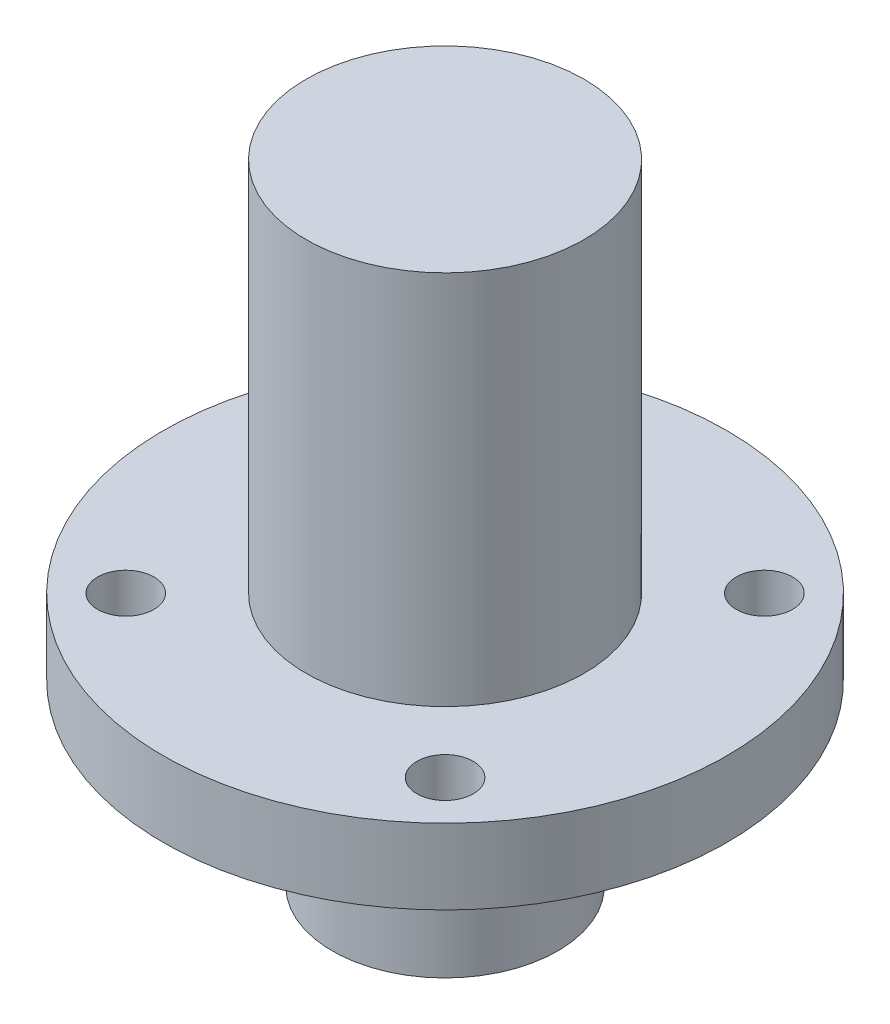
ISO-10303-21;
HEADER;
FILE_DESCRIPTION(('STEP AP214'),'2;1');
FILE_NAME('part.step','',(''),(''),'','','');
FILE_SCHEMA(('AUTOMOTIVE_DESIGN { 1 0 10303 214 1 1 1 1 }'));
ENDSEC;
DATA;
#1=APPLICATION_CONTEXT('core data for automotive mechanical design processes');
#2=APPLICATION_PROTOCOL_DEFINITION('international standard','automotive_design',2000,#1);
#3=PRODUCT_CONTEXT('',#1,'mechanical');
#4=PRODUCT('Part','Part','',(#3));
#5=PRODUCT_RELATED_PRODUCT_CATEGORY('part','',(#4));
#6=PRODUCT_DEFINITION_FORMATION('','',#4);
#7=PRODUCT_DEFINITION_CONTEXT('part definition',#1,'design');
#8=PRODUCT_DEFINITION('design','',#6,#7);
#9=PRODUCT_DEFINITION_SHAPE('','',#8);
#10=(LENGTH_UNIT() NAMED_UNIT(*) SI_UNIT(.MILLI.,.METRE.));
#11=(NAMED_UNIT(*) PLANE_ANGLE_UNIT() SI_UNIT($,.RADIAN.));
#12=(NAMED_UNIT(*) SI_UNIT($,.STERADIAN.) SOLID_ANGLE_UNIT());
#13=UNCERTAINTY_MEASURE_WITH_UNIT(LENGTH_MEASURE(1.E-05),#10,'distance_accuracy_value','');
#14=(GEOMETRIC_REPRESENTATION_CONTEXT(3) GLOBAL_UNCERTAINTY_ASSIGNED_CONTEXT((#13)) GLOBAL_UNIT_ASSIGNED_CONTEXT((#10,
#11,#12)) REPRESENTATION_CONTEXT('',''));
#15=CARTESIAN_POINT('',(0.,0.,0.));
#16=DIRECTION('',(0.,0.,1.));
#17=DIRECTION('',(1.,0.,0.));
#18=AXIS2_PLACEMENT_3D('',#15,#16,#17);
#19=CARTESIAN_POINT('',(0.,0.,0.));
#20=DIRECTION('',(0.,1.,0.));
#21=DIRECTION('',(0.,0.,1.));
#22=AXIS2_PLACEMENT_3D('',#19,#20,#21);
#23=PLANE('',#22);
#24=CARTESIAN_POINT('',(0.,0.,0.));
#25=DIRECTION('',(0.,1.,0.));
#26=DIRECTION('',(0.,0.,1.));
#27=AXIS2_PLACEMENT_3D('',#24,#25,#26);
#28=CIRCLE('',#27,3.);
#29=CARTESIAN_POINT('',(0.,0.,3.));
#30=VERTEX_POINT('',#29);
#31=EDGE_CURVE('E18',#30,#30,#28,.F.);
#32=ORIENTED_EDGE('',*,*,#31,.T.);
#33=EDGE_LOOP('',(#32));
#34=FACE_BOUND('',#33,.T.);
#35=ADVANCED_FACE('F15',(#34),#23,.F.);
#36=CARTESIAN_POINT('',(0.,-13.5,0.));
#37=DIRECTION('',(0.,1.,0.));
#38=DIRECTION('',(0.,0.,1.));
#39=AXIS2_PLACEMENT_3D('',#36,#37,#38);
#40=CYLINDRICAL_SURFACE('',#39,3.);
#41=CARTESIAN_POINT('',(0.,-13.5,0.));
#42=DIRECTION('',(0.,1.,0.));
#43=DIRECTION('',(0.,0.,1.));
#44=AXIS2_PLACEMENT_3D('',#41,#42,#43);
#45=CIRCLE('',#44,3.);
#46=CARTESIAN_POINT('',(0.,-13.5,3.00000000000001));
#47=VERTEX_POINT('',#46);
#48=EDGE_CURVE('E231',#47,#47,#45,.F.);
#49=ORIENTED_EDGE('',*,*,#48,.T.);
#50=EDGE_LOOP('',(#49));
#51=FACE_BOUND('',#50,.T.);
#52=ORIENTED_EDGE('',*,*,#31,.F.);
#53=EDGE_LOOP('',(#52));
#54=FACE_BOUND('',#53,.T.);
#55=CARTESIAN_POINT('',(0.,-7.875,3.));
#56=CARTESIAN_POINT('',(-0.0557681985187937,-7.87500315639322,2.99999771774197));
#57=CARTESIAN_POINT('',(-0.111592826024643,-7.87957270352456,2.99842813446581));
#58=CARTESIAN_POINT('',(-0.221651603388951,-7.89769444796325,2.99231039992411));
#59=CARTESIAN_POINT('',(-0.275882995246631,-7.91126136185447,2.98775736891462));
#60=CARTESIAN_POINT('',(-0.381064108690752,-7.94685282185869,2.97616923326795));
#61=CARTESIAN_POINT('',(-0.432021235043023,-7.9688574391952,2.96913998030726));
#62=CARTESIAN_POINT('',(-0.529502310394442,-8.02062537747109,2.95331495585036));
#63=CARTESIAN_POINT('',(-0.5760267382639,-8.05038785901734,2.94451937549263));
#64=CARTESIAN_POINT('',(-0.665032275740394,-8.11796397160462,2.92572548917805));
#65=CARTESIAN_POINT('',(-0.707331121420946,-8.15600930824795,2.91569723263784));
#66=CARTESIAN_POINT('',(-0.785090323506353,-8.23858034903304,2.89572929041068));
#67=CARTESIAN_POINT('',(-0.820548717152931,-8.28310790673287,2.88578963092323));
#68=CARTESIAN_POINT('',(-0.884675707013827,-8.3790377221472,2.86679334128091));
#69=CARTESIAN_POINT('',(-0.913104598672641,-8.43060806474581,2.85777282843763));
#70=CARTESIAN_POINT('',(-0.960807381799253,-8.53815557218786,2.842091546309));
#71=CARTESIAN_POINT('',(-0.980084266063647,-8.59413128944041,2.83543000579777));
#72=CARTESIAN_POINT('',(-1.00824803630976,-8.70683062889315,2.82553588146697));
#73=CARTESIAN_POINT('',(-1.01747641885596,-8.76345874846577,2.82219096584632));
#74=CARTESIAN_POINT('',(-1.02634892814108,-8.87755083519966,2.81897717112307));
#75=CARTESIAN_POINT('',(-1.02599619712845,-8.93501452214662,2.81910715238348));
#76=CARTESIAN_POINT('',(-1.01598088679388,-9.04619530743339,2.8227303144107));
#77=CARTESIAN_POINT('',(-1.00676909065796,-9.09995925258926,2.82606064296596));
#78=CARTESIAN_POINT('',(-0.980034319750464,-9.20512708523259,2.83544200336763));
#79=CARTESIAN_POINT('',(-0.962510265290577,-9.25653066517802,2.84149338864977));
#80=CARTESIAN_POINT('',(-0.919362270219811,-9.35652321249325,2.85574768071261));
#81=CARTESIAN_POINT('',(-0.893607838941182,-9.40505077363136,2.86398485872874));
#82=CARTESIAN_POINT('',(-0.834822148521472,-9.49723311869946,2.8816682615302));
#83=CARTESIAN_POINT('',(-0.801789081052105,-9.54088668765085,2.89111478652488));
#84=CARTESIAN_POINT('',(-0.727244000371621,-9.62460470054453,2.91078677867293));
#85=CARTESIAN_POINT('',(-0.685366143066111,-9.66434068128209,2.92102654251258));
#86=CARTESIAN_POINT('',(-0.595399732886537,-9.73632754507554,2.94068300072235));
#87=CARTESIAN_POINT('',(-0.547308452374756,-9.7685751232936,2.95009933054987));
#88=CARTESIAN_POINT('',(-0.445542723212907,-9.82495408056372,2.96718441032709));
#89=CARTESIAN_POINT('',(-0.391810123570138,-9.84898725527921,2.97483168401103));
#90=CARTESIAN_POINT('',(-0.280797281645059,-9.88753006308091,2.98734907044193));
#91=CARTESIAN_POINT('',(-0.223524548981399,-9.90205914629182,2.99222485234876));
#92=CARTESIAN_POINT('',(-0.138097332351485,-9.91603312806549,2.99694583737048));
#93=CARTESIAN_POINT('',(-0.110602454311793,-9.91939138097834,2.99808762097649));
#94=CARTESIAN_POINT('',(-0.0554096955060137,-9.92387560258351,2.99961526980968));
#95=CARTESIAN_POINT('',(-0.027711814482597,-9.92500156844565,3.00000113407847));
#96=CARTESIAN_POINT('',(0.0557681985187683,-9.92499684360696,2.99999771774204));
#97=CARTESIAN_POINT('',(0.111592826024614,-9.92042729647549,2.99842813446583));
#98=CARTESIAN_POINT('',(0.22165160338893,-9.90230555203671,2.99231039992409));
#99=CARTESIAN_POINT('',(0.275882995246622,-9.88873863814552,2.98775736891462));
#100=CARTESIAN_POINT('',(0.381064108690756,-9.85314717814132,2.97616923326796));
#101=CARTESIAN_POINT('',(0.432021235043028,-9.8311425608048,2.96913998030726));
#102=CARTESIAN_POINT('',(0.529502310394447,-9.77937462252891,2.95331495585036));
#103=CARTESIAN_POINT('',(0.576026738263903,-9.74961214098265,2.94451937549264));
#104=CARTESIAN_POINT('',(0.665032275740392,-9.68203602839538,2.92572548917806));
#105=CARTESIAN_POINT('',(0.707331121420941,-9.64399069175205,2.91569723263785));
#106=CARTESIAN_POINT('',(0.785090323506349,-9.56141965096697,2.89572929041068));
#107=CARTESIAN_POINT('',(0.820548717152929,-9.51689209326713,2.88578963092323));
#108=CARTESIAN_POINT('',(0.884675707013827,-9.4209622778528,2.86679334128091));
#109=CARTESIAN_POINT('',(0.913104598672639,-9.36939193525419,2.85777282843764));
#110=CARTESIAN_POINT('',(0.960807381799251,-9.26184442781214,2.842091546309));
#111=CARTESIAN_POINT('',(0.980084266063645,-9.20586871055959,2.83543000579777));
#112=CARTESIAN_POINT('',(1.00824803630976,-9.09316937110685,2.82553588146698));
#113=CARTESIAN_POINT('',(1.01747641885596,-9.03654125153423,2.82219096584633));
#114=CARTESIAN_POINT('',(1.02634892814108,-8.92244916480034,2.81897717112308));
#115=CARTESIAN_POINT('',(1.02599619712844,-8.86498547785338,2.81910715238348));
#116=CARTESIAN_POINT('',(1.01598088679388,-8.75380469256661,2.82273031441071));
#117=CARTESIAN_POINT('',(1.00676909065796,-8.70004074741075,2.82606064296596));
#118=CARTESIAN_POINT('',(0.980034319750463,-8.59487291476741,2.83544200336764));
#119=CARTESIAN_POINT('',(0.962510265290575,-8.54346933482198,2.84149338864977));
#120=CARTESIAN_POINT('',(0.919362270219808,-8.44347678750675,2.85574768071262));
#121=CARTESIAN_POINT('',(0.893607838941178,-8.39494922636864,2.86398485872874));
#122=CARTESIAN_POINT('',(0.834822148521468,-8.30276688130053,2.8816682615302));
#123=CARTESIAN_POINT('',(0.801789081052103,-8.25911331234914,2.89111478652488));
#124=CARTESIAN_POINT('',(0.72724400037162,-8.17539529945546,2.91078677867293));
#125=CARTESIAN_POINT('',(0.68536614306611,-8.1356593187179,2.92102654251258));
#126=CARTESIAN_POINT('',(0.595399732886536,-8.06367245492446,2.94068300072235));
#127=CARTESIAN_POINT('',(0.547308452374754,-8.0314248767064,2.95009933054988));
#128=CARTESIAN_POINT('',(0.445542723212901,-7.97504591943628,2.9671844103271));
#129=CARTESIAN_POINT('',(0.391810123570129,-7.95101274472078,2.97483168401103));
#130=CARTESIAN_POINT('',(0.280797281645049,-7.91246993691909,2.98734907044193));
#131=CARTESIAN_POINT('',(0.223524548981392,-7.8979408537082,2.99222485234875));
#132=CARTESIAN_POINT('',(0.138097332351482,-7.8839668719345,2.99694583737048));
#133=CARTESIAN_POINT('',(0.110602454311789,-7.88060861902163,2.9980876209765));
#134=CARTESIAN_POINT('',(0.0554096955060037,-7.87612439741651,2.99961526980967));
#135=CARTESIAN_POINT('',(0.0277118144825812,-7.87499843155444,3.00000113407843));
#136=CARTESIAN_POINT('',(0.,-7.875,3.));
#137=B_SPLINE_CURVE_WITH_KNOTS('',3,(#55,#56,#57,#58,#59,#60,#61,#62,#63,#64,#65,#66,#67,#68,
#69,#70,#71,#72,#73,#74,#75,#76,#77,#78,#79,#80,#81,#82,#83,#84,#85,#86,#87,#88,#89,#90,#91,#92,
#93,#94,#95,#96,#97,#98,#99,#100,#101,#102,#103,#104,#105,#106,#107,#108,#109,#110,#111,#112,
#113,#114,#115,#116,#117,#118,#119,#120,#121,#122,#123,#124,#125,#126,#127,#128,#129,#130,#131,
#132,#133,#134,#135,#136),.UNSPECIFIED.,.T.,.F.,(4,2,2,2,2,2,2,2,2,2,2,2,2,2,2,2,2,2,2,2,2,2,2,
2,2,2,2,2,2,2,2,2,2,2,2,2,2,2,2,2,4),(0.,0.167197591782786,0.334669337795041,0.501747949369005,
0.668808490703695,0.841338966433509,1.0139188736308,1.19175534529935,1.36953362256539,
1.54106092431714,1.71253197218093,1.87571556166074,2.03892035304202,2.20485305034403,
2.37082701908602,2.54590994772048,2.72106999903256,2.8982563179868,3.07507888115531,
3.15816104794855,3.2412433200764,3.40844091185919,3.57591265787147,3.74299126944545,
3.91005181078013,4.08258228650994,4.25516219370723,4.43299866537578,4.61077694264183,
4.78230424439357,4.95377529225736,5.11695888173717,5.28016367311845,5.44609637042047,
5.61207033916246,5.78715326779691,5.96231331910899,6.13949963806324,6.31632220123174,
6.39940436802499,6.48248664015285),.UNSPECIFIED.);
#138=CARTESIAN_POINT('',(0.,-7.875,3.));
#139=VERTEX_POINT('',#138);
#140=EDGE_CURVE('E233',#139,#139,#137,.T.);
#141=ORIENTED_EDGE('',*,*,#140,.T.);
#142=EDGE_LOOP('',(#141));
#143=FACE_BOUND('',#142,.T.);
#144=ADVANCED_FACE('F191',(#51,#54,#143),#40,.F.);
#145=CARTESIAN_POINT('',(0.,-13.5,0.));
#146=DIRECTION('',(0.,1.,0.));
#147=DIRECTION('',(0.,0.,1.));
#148=AXIS2_PLACEMENT_3D('',#145,#146,#147);
#149=PLANE('',#148);
#150=ORIENTED_EDGE('',*,*,#48,.F.);
#151=EDGE_LOOP('',(#150));
#152=FACE_BOUND('',#151,.T.);
#153=CARTESIAN_POINT('',(0.,-13.5,0.));
#154=DIRECTION('',(0.,-1.,0.));
#155=DIRECTION('',(0.,0.,-1.));
#156=AXIS2_PLACEMENT_3D('',#153,#154,#155);
#157=CIRCLE('',#156,6.);
#158=CARTESIAN_POINT('',(0.,-13.5,-5.99999999999999));
#159=VERTEX_POINT('',#158);
#160=EDGE_CURVE('E70',#159,#159,#157,.F.);
#161=ORIENTED_EDGE('',*,*,#160,.F.);
#162=EDGE_LOOP('',(#161));
#163=FACE_BOUND('',#162,.T.);
#164=ADVANCED_FACE('F183',(#152,#163),#149,.F.);
#165=CARTESIAN_POINT('',(0.,-8.9,0.));
#166=DIRECTION('',(0.,0.,1.));
#167=DIRECTION('',(1.,0.,0.));
#168=AXIS2_PLACEMENT_3D('',#165,#166,#167);
#169=CYLINDRICAL_SURFACE('',#168,1.025);
#170=CARTESIAN_POINT('',(0.,-9.925,6.));
#171=CARTESIAN_POINT('',(-0.0570727036526101,-9.9249973582478,5.99999888367395));
#172=CARTESIAN_POINT('',(-0.114217995291064,-9.92021299881119,5.99917649145897));
#173=CARTESIAN_POINT('',(-0.226947602401946,-9.90119890142921,5.9959727816822));
#174=CARTESIAN_POINT('',(-0.282528520665262,-9.88695004621472,5.99358830901916));
#175=CARTESIAN_POINT('',(-0.390417951477671,-9.8494494621417,5.98752779303888));
#176=CARTESIAN_POINT('',(-0.442730505593948,-9.82620911850284,5.98385338361059));
#177=CARTESIAN_POINT('',(-0.542692117283802,-9.77141215801521,5.97561743459344));
#178=CARTESIAN_POINT('',(-0.590342881129701,-9.73985859963919,5.97105622142544));
#179=CARTESIAN_POINT('',(-0.680134678509647,-9.66898789111447,5.96149953964205));
#180=CARTESIAN_POINT('',(-0.722221772129052,-9.62960286828461,5.95650050498386));
#181=CARTESIAN_POINT('',(-0.799226339431639,-9.54433149838726,5.94665855670755));
#182=CARTESIAN_POINT('',(-0.834142977213231,-9.49844439438705,5.9418156613469));
#183=CARTESIAN_POINT('',(-0.896027458481574,-9.40110569336643,5.93280055773456));
#184=CARTESIAN_POINT('',(-0.922942448182577,-9.34962003658294,5.92863288836528));
#185=CARTESIAN_POINT('',(-0.967721214157244,-9.2427756448839,5.92148909073923));
#186=CARTESIAN_POINT('',(-0.985585711820138,-9.18741721905628,5.91851286751961));
#187=CARTESIAN_POINT('',(-1.01158815815292,-9.07496449242363,5.91412405394062));
#188=CARTESIAN_POINT('',(-1.01981833166631,-9.01789210606765,5.91269664730548));
#189=CARTESIAN_POINT('',(-1.02660450284924,-8.90315987633103,5.9115222948616));
#190=CARTESIAN_POINT('',(-1.02516120394753,-8.84550007597,5.91177522686318));
#191=CARTESIAN_POINT('',(-1.01271648200547,-8.73189059075329,5.91391944934594));
#192=CARTESIAN_POINT('',(-1.00181898478487,-8.67592913659646,5.91579292524544));
#193=CARTESIAN_POINT('',(-0.970938254331943,-8.56664026185383,5.92093926230969));
#194=CARTESIAN_POINT('',(-0.950954621256656,-8.51331295730047,5.92421218505789));
#195=CARTESIAN_POINT('',(-0.902363485934301,-8.41049523788171,5.93180788822082));
#196=CARTESIAN_POINT('',(-0.873712780861271,-8.3610256434342,5.93613590649742));
#197=CARTESIAN_POINT('',(-0.80863378747684,-8.26756067045512,5.94535011285502));
#198=CARTESIAN_POINT('',(-0.772205437461037,-8.22356533535829,5.95023630536419));
#199=CARTESIAN_POINT('',(-0.692047288877386,-8.14169967602171,5.96009383827313));
#200=CARTESIAN_POINT('',(-0.648229691177217,-8.10391531214324,5.96506546606228));
#201=CARTESIAN_POINT('',(-0.554808086968544,-8.03620514278666,5.97447808051634));
#202=CARTESIAN_POINT('',(-0.505201511585977,-8.00628284541836,5.97891882981946));
#203=CARTESIAN_POINT('',(-0.401514356395531,-7.95513989173958,5.98677656749847));
#204=CARTESIAN_POINT('',(-0.347426280826661,-7.93393418282629,5.99019179460692));
#205=CARTESIAN_POINT('',(-0.236455850980942,-7.90097505688313,5.99559485949407));
#206=CARTESIAN_POINT('',(-0.179579655006954,-7.88920172312246,5.9975857039411));
#207=CARTESIAN_POINT('',(-0.101907672807836,-7.87987325795214,5.99916915421192));
#208=CARTESIAN_POINT('',(-0.0815729093342667,-7.8780472691695,5.99948005321213));
#209=CARTESIAN_POINT('',(-0.0408285276930976,-7.87561016708081,5.99989567589232));
#210=CARTESIAN_POINT('',(-0.0204189094586521,-7.87499905485993,6.00000039938813));
#211=CARTESIAN_POINT('',(0.0570727036525954,-7.8750026417522,5.99999888367395));
#212=CARTESIAN_POINT('',(0.114217995291049,-7.87978700118881,5.99917649145897));
#213=CARTESIAN_POINT('',(0.226947602401932,-7.89880109857079,5.9959727816822));
#214=CARTESIAN_POINT('',(0.282528520665247,-7.91304995378528,5.99358830901916));
#215=CARTESIAN_POINT('',(0.390417951477658,-7.9505505378583,5.98752779303888));
#216=CARTESIAN_POINT('',(0.442730505593937,-7.97379088149716,5.98385338361059));
#217=CARTESIAN_POINT('',(0.542692117283791,-8.02858784198478,5.97561743459344));
#218=CARTESIAN_POINT('',(0.590342881129688,-8.06014140036081,5.97105622142544));
#219=CARTESIAN_POINT('',(0.680134678509635,-8.13101210888553,5.96149953964205));
#220=CARTESIAN_POINT('',(0.722221772129043,-8.17039713171538,5.95650050498387));
#221=CARTESIAN_POINT('',(0.799226339431631,-8.25566850161273,5.94665855670755));
#222=CARTESIAN_POINT('',(0.834142977213222,-8.30155560561295,5.9418156613469));
#223=CARTESIAN_POINT('',(0.896027458481564,-8.39889430663356,5.93280055773456));
#224=CARTESIAN_POINT('',(0.922942448182568,-8.45037996341705,5.92863288836528));
#225=CARTESIAN_POINT('',(0.967721214157236,-8.55722435511609,5.92148909073923));
#226=CARTESIAN_POINT('',(0.98558571182013,-8.61258278094371,5.91851286751961));
#227=CARTESIAN_POINT('',(1.01158815815291,-8.72503550757636,5.91412405394062));
#228=CARTESIAN_POINT('',(1.0198183316663,-8.78210789393234,5.91269664730548));
#229=CARTESIAN_POINT('',(1.02660450284924,-8.89684012366896,5.91152229486161));
#230=CARTESIAN_POINT('',(1.02516120394753,-8.95449992402999,5.91177522686318));
#231=CARTESIAN_POINT('',(1.01271648200547,-9.0681094092467,5.91391944934594));
#232=CARTESIAN_POINT('',(1.00181898478487,-9.12407086340352,5.91579292524544));
#233=CARTESIAN_POINT('',(0.970938254331942,-9.23335973814616,5.9209392623097));
#234=CARTESIAN_POINT('',(0.950954621256657,-9.28668704269952,5.92421218505789));
#235=CARTESIAN_POINT('',(0.902363485934303,-9.38950476211828,5.93180788822082));
#236=CARTESIAN_POINT('',(0.873712780861273,-9.43897435656579,5.93613590649743));
#237=CARTESIAN_POINT('',(0.808633787476842,-9.53243932954487,5.94535011285503));
#238=CARTESIAN_POINT('',(0.77220543746104,-9.5764346646417,5.95023630536419));
#239=CARTESIAN_POINT('',(0.69204728887739,-9.65830032397828,5.96009383827313));
#240=CARTESIAN_POINT('',(0.648229691177221,-9.69608468785675,5.96506546606229));
#241=CARTESIAN_POINT('',(0.554808086968548,-9.76379485721333,5.97447808051634));
#242=CARTESIAN_POINT('',(0.505201511585981,-9.79371715458164,5.97891882981946));
#243=CARTESIAN_POINT('',(0.401514356395536,-9.84486010826042,5.98677656749847));
#244=CARTESIAN_POINT('',(0.347426280826665,-9.86606581717371,5.99019179460692));
#245=CARTESIAN_POINT('',(0.236455850980948,-9.89902494311687,5.99559485949407));
#246=CARTESIAN_POINT('',(0.179579655006962,-9.91079827687754,5.9975857039411));
#247=CARTESIAN_POINT('',(0.10190767280784,-9.92012674204786,5.99916915421192));
#248=CARTESIAN_POINT('',(0.0815729093342669,-9.9219527308305,5.99948005321214));
#249=CARTESIAN_POINT('',(0.04082852769309,-9.92438983291918,5.99989567589232));
#250=CARTESIAN_POINT('',(0.0204189094586408,-9.92500094514007,6.00000039938813));
#251=CARTESIAN_POINT('',(0.,-9.925,6.));
#252=B_SPLINE_CURVE_WITH_KNOTS('',3,(#170,#171,#172,#173,#174,#175,#176,#177,#178,#179,#180,
#181,#182,#183,#184,#185,#186,#187,#188,#189,#190,#191,#192,#193,#194,#195,#196,#197,#198,#199,
#200,#201,#202,#203,#204,#205,#206,#207,#208,#209,#210,#211,#212,#213,#214,#215,#216,#217,#218,
#219,#220,#221,#222,#223,#224,#225,#226,#227,#228,#229,#230,#231,#232,#233,#234,#235,#236,#237,
#238,#239,#240,#241,#242,#243,#244,#245,#246,#247,#248,#249,#250,#251),.UNSPECIFIED.,.T.,.F.,(4,
2,2,2,2,2,2,2,2,2,2,2,2,2,2,2,2,2,2,2,2,2,2,2,2,2,2,2,2,2,2,2,2,2,2,2,2,2,2,2,4),(0.,
0.171140157064412,0.342627054445387,0.513897518291094,0.685105058665001,0.857866705053767,
1.0306484798504,1.20454740085766,1.37843245869008,1.55063902097633,1.72283306100317,
1.89315789312309,2.06349022125438,2.2346860025451,2.40588314207803,2.57927991361465,
2.75275392512924,2.92652418499491,3.09992654971796,3.16115533382726,3.22238417262745,
3.39352432969186,3.56501122707284,3.73628169091855,3.90748923129245,4.08025087768122,
4.25303265247785,4.42693157348511,4.60081663131753,4.77302319360378,4.94521723363062,
5.11554206575054,5.28587439388183,5.45707017517255,5.62826731470547,5.8016640862421,
5.97513809775669,6.14890835762237,6.32231072234541,6.38353950645472,6.44476834525492),.UNSPECIFIED.);
#253=CARTESIAN_POINT('',(0.,-9.925,6.));
#254=VERTEX_POINT('',#253);
#255=EDGE_CURVE('E62',#254,#254,#252,.T.);
#256=ORIENTED_EDGE('',*,*,#255,.F.);
#257=EDGE_LOOP('',(#256));
#258=FACE_BOUND('',#257,.T.);
#259=ORIENTED_EDGE('',*,*,#140,.F.);
#260=EDGE_LOOP('',(#259));
#261=FACE_BOUND('',#260,.T.);
#262=ADVANCED_FACE('F72',(#258,#261),#169,.F.);
#263=CARTESIAN_POINT('',(0.,-4.,0.));
#264=DIRECTION('',(0.,-1.,0.));
#265=DIRECTION('',(0.,0.,-1.));
#266=AXIS2_PLACEMENT_3D('',#263,#264,#265);
#267=CYLINDRICAL_SURFACE('',#266,6.);
#268=ORIENTED_EDGE('',*,*,#160,.T.);
#269=EDGE_LOOP('',(#268));
#270=FACE_BOUND('',#269,.T.);
#271=CARTESIAN_POINT('',(0.,-4.,0.));
#272=DIRECTION('',(0.,-1.,0.));
#273=DIRECTION('',(0.,0.,-1.));
#274=AXIS2_PLACEMENT_3D('',#271,#272,#273);
#275=CIRCLE('',#274,6.);
#276=CARTESIAN_POINT('',(0.,-4.00000000000001,-6.));
#277=VERTEX_POINT('',#276);
#278=EDGE_CURVE('E59',#277,#277,#275,.T.);
#279=ORIENTED_EDGE('',*,*,#278,.T.);
#280=EDGE_LOOP('',(#279));
#281=FACE_BOUND('',#280,.T.);
#282=ORIENTED_EDGE('',*,*,#255,.T.);
#283=EDGE_LOOP('',(#282));
#284=FACE_BOUND('',#283,.T.);
#285=ADVANCED_FACE('F75',(#270,#281,#284),#267,.T.);
#286=CARTESIAN_POINT('',(0.,-4.,0.));
#287=DIRECTION('',(0.,1.,0.));
#288=DIRECTION('',(0.,0.,1.));
#289=AXIS2_PLACEMENT_3D('',#286,#287,#288);
#290=PLANE('',#289);
#291=CARTESIAN_POINT('',(8.5,-4.,8.5));
#292=DIRECTION('',(0.,1.,0.));
#293=DIRECTION('',(0.,0.,1.));
#294=AXIS2_PLACEMENT_3D('',#291,#292,#293);
#295=CIRCLE('',#294,1.5);
#296=CARTESIAN_POINT('',(8.5,-4.,10.));
#297=VERTEX_POINT('',#296);
#298=EDGE_CURVE('E47',#297,#297,#295,.T.);
#299=ORIENTED_EDGE('',*,*,#298,.T.);
#300=EDGE_LOOP('',(#299));
#301=FACE_BOUND('',#300,.T.);
#302=ORIENTED_EDGE('',*,*,#278,.F.);
#303=EDGE_LOOP('',(#302));
#304=FACE_BOUND('',#303,.T.);
#305=CARTESIAN_POINT('',(8.5,-4.,-8.5));
#306=DIRECTION('',(0.,1.,0.));
#307=DIRECTION('',(0.,0.,1.));
#308=AXIS2_PLACEMENT_3D('',#305,#306,#307);
#309=CIRCLE('',#308,1.5);
#310=CARTESIAN_POINT('',(8.5,-4.,-7.));
#311=VERTEX_POINT('',#310);
#312=EDGE_CURVE('E44',#311,#311,#309,.T.);
#313=ORIENTED_EDGE('',*,*,#312,.T.);
#314=EDGE_LOOP('',(#313));
#315=FACE_BOUND('',#314,.T.);
#316=CARTESIAN_POINT('',(-8.5,-4.,8.5));
#317=DIRECTION('',(0.,1.,0.));
#318=DIRECTION('',(0.,0.,1.));
#319=AXIS2_PLACEMENT_3D('',#316,#317,#318);
#320=CIRCLE('',#319,1.5);
#321=CARTESIAN_POINT('',(-8.5,-4.,10.));
#322=VERTEX_POINT('',#321);
#323=EDGE_CURVE('E53',#322,#322,#320,.T.);
#324=ORIENTED_EDGE('',*,*,#323,.T.);
#325=EDGE_LOOP('',(#324));
#326=FACE_BOUND('',#325,.T.);
#327=CARTESIAN_POINT('',(-8.5,-4.,-8.5));
#328=DIRECTION('',(0.,1.,0.));
#329=DIRECTION('',(0.,0.,1.));
#330=AXIS2_PLACEMENT_3D('',#327,#328,#329);
#331=CIRCLE('',#330,1.5);
#332=CARTESIAN_POINT('',(-8.5,-4.,-7.));
#333=VERTEX_POINT('',#332);
#334=EDGE_CURVE('E50',#333,#333,#331,.T.);
#335=ORIENTED_EDGE('',*,*,#334,.T.);
#336=EDGE_LOOP('',(#335));
#337=FACE_BOUND('',#336,.T.);
#338=CARTESIAN_POINT('',(0.,-4.,0.));
#339=DIRECTION('',(0.,-1.,0.));
#340=DIRECTION('',(0.,0.,-1.));
#341=AXIS2_PLACEMENT_3D('',#338,#339,#340);
#342=CIRCLE('',#341,15.);
#343=CARTESIAN_POINT('',(0.,-4.00000000000001,-15.));
#344=VERTEX_POINT('',#343);
#345=EDGE_CURVE('E56',#344,#344,#342,.F.);
#346=ORIENTED_EDGE('',*,*,#345,.F.);
#347=EDGE_LOOP('',(#346));
#348=FACE_BOUND('',#347,.T.);
#349=ADVANCED_FACE('F79',(#301,#304,#315,#326,#337,#348),#290,.F.);
#350=CARTESIAN_POINT('',(0.,0.,0.));
#351=DIRECTION('',(0.,-1.,0.));
#352=DIRECTION('',(0.,0.,-1.));
#353=AXIS2_PLACEMENT_3D('',#350,#351,#352);
#354=CYLINDRICAL_SURFACE('',#353,15.);
#355=ORIENTED_EDGE('',*,*,#345,.T.);
#356=EDGE_LOOP('',(#355));
#357=FACE_BOUND('',#356,.T.);
#358=CARTESIAN_POINT('',(0.,0.,0.));
#359=DIRECTION('',(0.,-1.,0.));
#360=DIRECTION('',(0.,0.,-1.));
#361=AXIS2_PLACEMENT_3D('',#358,#359,#360);
#362=CIRCLE('',#361,15.);
#363=CARTESIAN_POINT('',(0.,0.,-15.));
#364=VERTEX_POINT('',#363);
#365=EDGE_CURVE('E41',#364,#364,#362,.T.);
#366=ORIENTED_EDGE('',*,*,#365,.T.);
#367=EDGE_LOOP('',(#366));
#368=FACE_BOUND('',#367,.T.);
#369=ADVANCED_FACE('F83',(#357,#368),#354,.T.);
#370=CARTESIAN_POINT('',(-8.5,0.,8.5));
#371=DIRECTION('',(0.,1.,0.));
#372=DIRECTION('',(0.,0.,1.));
#373=AXIS2_PLACEMENT_3D('',#370,#371,#372);
#374=CYLINDRICAL_SURFACE('',#373,1.5);
#375=ORIENTED_EDGE('',*,*,#323,.F.);
#376=EDGE_LOOP('',(#375));
#377=FACE_BOUND('',#376,.T.);
#378=CARTESIAN_POINT('',(-8.5,0.,8.5));
#379=DIRECTION('',(0.,1.,0.));
#380=DIRECTION('',(0.,0.,1.));
#381=AXIS2_PLACEMENT_3D('',#378,#379,#380);
#382=CIRCLE('',#381,1.5);
#383=CARTESIAN_POINT('',(-8.5,0.,10.));
#384=VERTEX_POINT('',#383);
#385=EDGE_CURVE('E38',#384,#384,#382,.T.);
#386=ORIENTED_EDGE('',*,*,#385,.T.);
#387=EDGE_LOOP('',(#386));
#388=FACE_BOUND('',#387,.T.);
#389=ADVANCED_FACE('F87',(#377,#388),#374,.F.);
#390=CARTESIAN_POINT('',(-8.5,0.,-8.5));
#391=DIRECTION('',(0.,1.,0.));
#392=DIRECTION('',(0.,0.,1.));
#393=AXIS2_PLACEMENT_3D('',#390,#391,#392);
#394=CYLINDRICAL_SURFACE('',#393,1.5);
#395=ORIENTED_EDGE('',*,*,#334,.F.);
#396=EDGE_LOOP('',(#395));
#397=FACE_BOUND('',#396,.T.);
#398=CARTESIAN_POINT('',(-8.5,0.,-8.5));
#399=DIRECTION('',(0.,1.,0.));
#400=DIRECTION('',(0.,0.,1.));
#401=AXIS2_PLACEMENT_3D('',#398,#399,#400);
#402=CIRCLE('',#401,1.5);
#403=CARTESIAN_POINT('',(-8.5,0.,-7.));
#404=VERTEX_POINT('',#403);
#405=EDGE_CURVE('E35',#404,#404,#402,.T.);
#406=ORIENTED_EDGE('',*,*,#405,.T.);
#407=EDGE_LOOP('',(#406));
#408=FACE_BOUND('',#407,.T.);
#409=ADVANCED_FACE('F91',(#397,#408),#394,.F.);
#410=CARTESIAN_POINT('',(8.5,0.,8.5));
#411=DIRECTION('',(0.,1.,0.));
#412=DIRECTION('',(0.,0.,1.));
#413=AXIS2_PLACEMENT_3D('',#410,#411,#412);
#414=CYLINDRICAL_SURFACE('',#413,1.5);
#415=ORIENTED_EDGE('',*,*,#298,.F.);
#416=EDGE_LOOP('',(#415));
#417=FACE_BOUND('',#416,.T.);
#418=CARTESIAN_POINT('',(8.5,0.,8.5));
#419=DIRECTION('',(0.,1.,0.));
#420=DIRECTION('',(0.,0.,1.));
#421=AXIS2_PLACEMENT_3D('',#418,#419,#420);
#422=CIRCLE('',#421,1.5);
#423=CARTESIAN_POINT('',(8.5,0.,10.));
#424=VERTEX_POINT('',#423);
#425=EDGE_CURVE('E32',#424,#424,#422,.T.);
#426=ORIENTED_EDGE('',*,*,#425,.T.);
#427=EDGE_LOOP('',(#426));
#428=FACE_BOUND('',#427,.T.);
#429=ADVANCED_FACE('F95',(#417,#428),#414,.F.);
#430=CARTESIAN_POINT('',(8.5,0.,-8.5));
#431=DIRECTION('',(0.,1.,0.));
#432=DIRECTION('',(0.,0.,1.));
#433=AXIS2_PLACEMENT_3D('',#430,#431,#432);
#434=CYLINDRICAL_SURFACE('',#433,1.5);
#435=ORIENTED_EDGE('',*,*,#312,.F.);
#436=EDGE_LOOP('',(#435));
#437=FACE_BOUND('',#436,.T.);
#438=CARTESIAN_POINT('',(8.5,0.,-8.5));
#439=DIRECTION('',(0.,1.,0.));
#440=DIRECTION('',(0.,0.,1.));
#441=AXIS2_PLACEMENT_3D('',#438,#439,#440);
#442=CIRCLE('',#441,1.5);
#443=CARTESIAN_POINT('',(8.5,0.,-7.));
#444=VERTEX_POINT('',#443);
#445=EDGE_CURVE('E27',#444,#444,#442,.T.);
#446=ORIENTED_EDGE('',*,*,#445,.T.);
#447=EDGE_LOOP('',(#446));
#448=FACE_BOUND('',#447,.T.);
#449=ADVANCED_FACE('F99',(#437,#448),#434,.F.);
#450=CARTESIAN_POINT('',(0.,0.,0.));
#451=DIRECTION('',(0.,-1.,0.));
#452=DIRECTION('',(0.,0.,-1.));
#453=AXIS2_PLACEMENT_3D('',#450,#451,#452);
#454=PLANE('',#453);
#455=ORIENTED_EDGE('',*,*,#445,.F.);
#456=EDGE_LOOP('',(#455));
#457=FACE_BOUND('',#456,.T.);
#458=ORIENTED_EDGE('',*,*,#425,.F.);
#459=EDGE_LOOP('',(#458));
#460=FACE_BOUND('',#459,.T.);
#461=CARTESIAN_POINT('',(0.,0.,0.));
#462=DIRECTION('',(0.,-1.,0.));
#463=DIRECTION('',(0.,0.,-1.));
#464=AXIS2_PLACEMENT_3D('',#461,#462,#463);
#465=CIRCLE('',#464,7.4);
#466=CARTESIAN_POINT('',(0.,0.,-7.4));
#467=VERTEX_POINT('',#466);
#468=EDGE_CURVE('E22',#467,#467,#465,.F.);
#469=ORIENTED_EDGE('',*,*,#468,.F.);
#470=EDGE_LOOP('',(#469));
#471=FACE_BOUND('',#470,.T.);
#472=ORIENTED_EDGE('',*,*,#405,.F.);
#473=EDGE_LOOP('',(#472));
#474=FACE_BOUND('',#473,.T.);
#475=ORIENTED_EDGE('',*,*,#385,.F.);
#476=EDGE_LOOP('',(#475));
#477=FACE_BOUND('',#476,.T.);
#478=ORIENTED_EDGE('',*,*,#365,.F.);
#479=EDGE_LOOP('',(#478));
#480=FACE_BOUND('',#479,.T.);
#481=ADVANCED_FACE('F103',(#457,#460,#471,#474,#477,#480),#454,.F.);
#482=CARTESIAN_POINT('',(0.,20.,0.));
#483=DIRECTION('',(0.,-1.,0.));
#484=DIRECTION('',(0.,0.,-1.));
#485=AXIS2_PLACEMENT_3D('',#482,#483,#484);
#486=PLANE('',#485);
#487=CARTESIAN_POINT('',(0.,20.,0.));
#488=DIRECTION('',(0.,-1.,0.));
#489=DIRECTION('',(0.,0.,-1.));
#490=AXIS2_PLACEMENT_3D('',#487,#488,#489);
#491=CIRCLE('',#490,7.4);
#492=CARTESIAN_POINT('',(0.,20.,-7.40000000000002));
#493=VERTEX_POINT('',#492);
#494=EDGE_CURVE('E10',#493,#493,#491,.T.);
#495=ORIENTED_EDGE('',*,*,#494,.F.);
#496=EDGE_LOOP('',(#495));
#497=FACE_BOUND('',#496,.T.);
#498=ADVANCED_FACE('F107',(#497),#486,.F.);
#499=CARTESIAN_POINT('',(0.,20.,0.));
#500=DIRECTION('',(0.,-1.,0.));
#501=DIRECTION('',(0.,0.,-1.));
#502=AXIS2_PLACEMENT_3D('',#499,#500,#501);
#503=CYLINDRICAL_SURFACE('',#502,7.4);
#504=ORIENTED_EDGE('',*,*,#468,.T.);
#505=EDGE_LOOP('',(#504));
#506=FACE_BOUND('',#505,.T.);
#507=ORIENTED_EDGE('',*,*,#494,.T.);
#508=EDGE_LOOP('',(#507));
#509=FACE_BOUND('',#508,.T.);
#510=ADVANCED_FACE('F111',(#506,#509),#503,.T.);
#511=CLOSED_SHELL('',(#35,#144,#164,#262,#285,#349,#369,#389,#409,#429,#449,#481,#498,#510));
#512=MANIFOLD_SOLID_BREP('B1',#511);
#513=ADVANCED_BREP_SHAPE_REPRESENTATION('',(#18,#512),#14);
#514=SHAPE_DEFINITION_REPRESENTATION(#9,#513);
ENDSEC;
END-ISO-10303-21;
